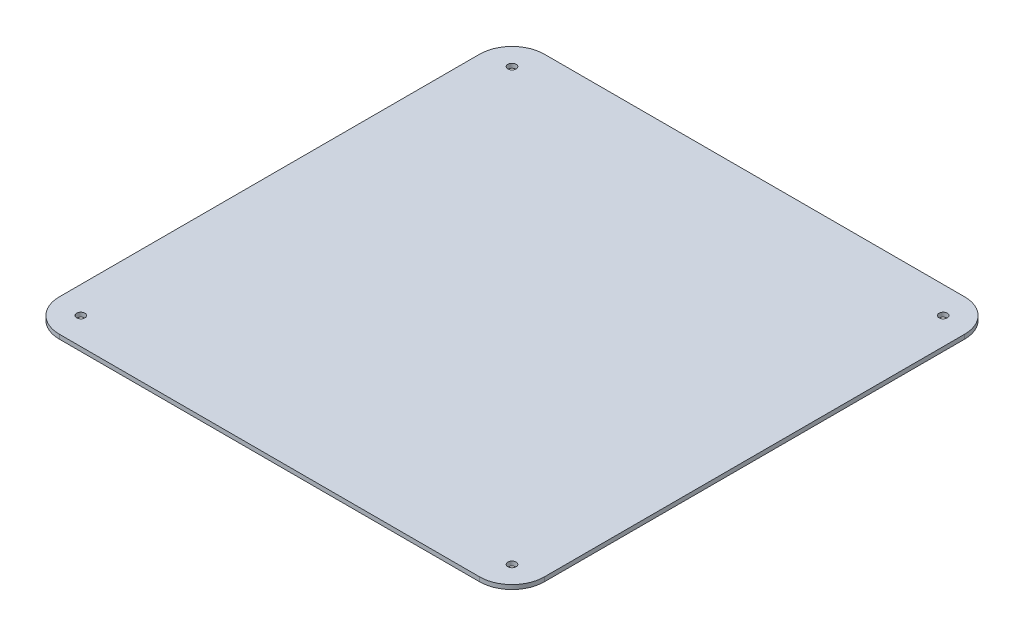
ISO-10303-21;
HEADER;
FILE_DESCRIPTION(('STEP AP214'),'2;1');
FILE_NAME('part.step','',(''),(''),'','','');
FILE_SCHEMA(('AUTOMOTIVE_DESIGN { 1 0 10303 214 1 1 1 1 }'));
ENDSEC;
DATA;
#1=APPLICATION_CONTEXT('core data for automotive mechanical design processes');
#2=APPLICATION_PROTOCOL_DEFINITION('international standard','automotive_design',2000,#1);
#3=PRODUCT_CONTEXT('',#1,'mechanical');
#4=PRODUCT('Part','Part','',(#3));
#5=PRODUCT_RELATED_PRODUCT_CATEGORY('part','',(#4));
#6=PRODUCT_DEFINITION_FORMATION('','',#4);
#7=PRODUCT_DEFINITION_CONTEXT('part definition',#1,'design');
#8=PRODUCT_DEFINITION('design','',#6,#7);
#9=PRODUCT_DEFINITION_SHAPE('','',#8);
#10=(LENGTH_UNIT() NAMED_UNIT(*) SI_UNIT(.MILLI.,.METRE.));
#11=(NAMED_UNIT(*) PLANE_ANGLE_UNIT() SI_UNIT($,.RADIAN.));
#12=(NAMED_UNIT(*) SI_UNIT($,.STERADIAN.) SOLID_ANGLE_UNIT());
#13=UNCERTAINTY_MEASURE_WITH_UNIT(LENGTH_MEASURE(1.E-05),#10,'distance_accuracy_value','');
#14=(GEOMETRIC_REPRESENTATION_CONTEXT(3) GLOBAL_UNCERTAINTY_ASSIGNED_CONTEXT((#13)) GLOBAL_UNIT_ASSIGNED_CONTEXT((#10,
#11,#12)) REPRESENTATION_CONTEXT('',''));
#15=CARTESIAN_POINT('',(0.,0.,0.));
#16=DIRECTION('',(0.,0.,1.));
#17=DIRECTION('',(1.,0.,0.));
#18=AXIS2_PLACEMENT_3D('',#15,#16,#17);
#19=CARTESIAN_POINT('',(225.,-4.,225.));
#20=DIRECTION('',(1.,0.,0.));
#21=DIRECTION('',(0.,0.,-1.));
#22=AXIS2_PLACEMENT_3D('',#19,#20,#21);
#23=PLANE('',#22);
#24=DIRECTION('',(0.,0.,-1.));
#25=VECTOR('',#24,1.);
#26=CARTESIAN_POINT('',(225.,-4.,225.));
#27=LINE('',#26,#25);
#28=CARTESIAN_POINT('',(225.,-4.,195.));
#29=VERTEX_POINT('',#28);
#30=CARTESIAN_POINT('',(225.,-4.,-195.));
#31=VERTEX_POINT('',#30);
#32=EDGE_CURVE('E167',#29,#31,#27,.T.);
#33=ORIENTED_EDGE('',*,*,#32,.T.);
#34=DIRECTION('',(0.,1.,0.));
#35=VECTOR('',#34,1.);
#36=CARTESIAN_POINT('',(225.,-4.,-195.));
#37=LINE('',#36,#35);
#38=CARTESIAN_POINT('',(225.,0.,-195.));
#39=VERTEX_POINT('',#38);
#40=EDGE_CURVE('E114',#31,#39,#37,.T.);
#41=ORIENTED_EDGE('',*,*,#40,.T.);
#42=DIRECTION('',(0.,0.,-1.));
#43=VECTOR('',#42,1.);
#44=CARTESIAN_POINT('',(225.,0.,225.));
#45=LINE('',#44,#43);
#46=CARTESIAN_POINT('',(225.,0.,195.));
#47=VERTEX_POINT('',#46);
#48=EDGE_CURVE('E106',#47,#39,#45,.T.);
#49=ORIENTED_EDGE('',*,*,#48,.F.);
#50=DIRECTION('',(0.,1.,0.));
#51=VECTOR('',#50,1.);
#52=CARTESIAN_POINT('',(225.,-4.,195.));
#53=LINE('',#52,#51);
#54=EDGE_CURVE('E119',#47,#29,#53,.F.);
#55=ORIENTED_EDGE('',*,*,#54,.T.);
#56=EDGE_LOOP('',(#33,#41,#49,#55));
#57=FACE_BOUND('',#56,.T.);
#58=ADVANCED_FACE('F37',(#57),#23,.T.);
#59=CARTESIAN_POINT('',(-225.,-4.,225.));
#60=DIRECTION('',(0.,0.,1.));
#61=DIRECTION('',(1.,0.,0.));
#62=AXIS2_PLACEMENT_3D('',#59,#60,#61);
#63=PLANE('',#62);
#64=DIRECTION('',(1.,0.,0.));
#65=VECTOR('',#64,1.);
#66=CARTESIAN_POINT('',(-225.,0.,225.));
#67=LINE('',#66,#65);
#68=CARTESIAN_POINT('',(-195.,0.,225.));
#69=VERTEX_POINT('',#68);
#70=CARTESIAN_POINT('',(195.,0.,225.));
#71=VERTEX_POINT('',#70);
#72=EDGE_CURVE('E108',#69,#71,#67,.T.);
#73=ORIENTED_EDGE('',*,*,#72,.F.);
#74=DIRECTION('',(0.,1.,0.));
#75=VECTOR('',#74,1.);
#76=CARTESIAN_POINT('',(-195.,-4.,225.));
#77=LINE('',#76,#75);
#78=CARTESIAN_POINT('',(-195.,-4.,225.));
#79=VERTEX_POINT('',#78);
#80=EDGE_CURVE('E11',#69,#79,#77,.F.);
#81=ORIENTED_EDGE('',*,*,#80,.T.);
#82=DIRECTION('',(1.,0.,0.));
#83=VECTOR('',#82,1.);
#84=CARTESIAN_POINT('',(-225.,-4.,225.));
#85=LINE('',#84,#83);
#86=CARTESIAN_POINT('',(195.,-4.,225.));
#87=VERTEX_POINT('',#86);
#88=EDGE_CURVE('E127',#79,#87,#85,.T.);
#89=ORIENTED_EDGE('',*,*,#88,.T.);
#90=DIRECTION('',(0.,1.,0.));
#91=VECTOR('',#90,1.);
#92=CARTESIAN_POINT('',(195.,-4.,225.));
#93=LINE('',#92,#91);
#94=EDGE_CURVE('E45',#87,#71,#93,.T.);
#95=ORIENTED_EDGE('',*,*,#94,.T.);
#96=EDGE_LOOP('',(#73,#81,#89,#95));
#97=FACE_BOUND('',#96,.T.);
#98=ADVANCED_FACE('F156',(#97),#63,.T.);
#99=CARTESIAN_POINT('',(-225.,-4.,225.));
#100=DIRECTION('',(-1.,0.,0.));
#101=DIRECTION('',(0.,0.,1.));
#102=AXIS2_PLACEMENT_3D('',#99,#100,#101);
#103=PLANE('',#102);
#104=DIRECTION('',(0.,0.,1.));
#105=VECTOR('',#104,1.);
#106=CARTESIAN_POINT('',(-225.,0.,225.));
#107=LINE('',#106,#105);
#108=CARTESIAN_POINT('',(-225.,0.,-195.));
#109=VERTEX_POINT('',#108);
#110=CARTESIAN_POINT('',(-225.,0.,195.));
#111=VERTEX_POINT('',#110);
#112=EDGE_CURVE('E165',#109,#111,#107,.T.);
#113=ORIENTED_EDGE('',*,*,#112,.F.);
#114=DIRECTION('',(0.,1.,0.));
#115=VECTOR('',#114,1.);
#116=CARTESIAN_POINT('',(-225.,-4.,-195.));
#117=LINE('',#116,#115);
#118=CARTESIAN_POINT('',(-225.,-4.,-195.));
#119=VERTEX_POINT('',#118);
#120=EDGE_CURVE('E59',#109,#119,#117,.F.);
#121=ORIENTED_EDGE('',*,*,#120,.T.);
#122=DIRECTION('',(0.,0.,1.));
#123=VECTOR('',#122,1.);
#124=CARTESIAN_POINT('',(-225.,-4.,225.));
#125=LINE('',#124,#123);
#126=CARTESIAN_POINT('',(-225.,-4.,195.));
#127=VERTEX_POINT('',#126);
#128=EDGE_CURVE('E131',#119,#127,#125,.T.);
#129=ORIENTED_EDGE('',*,*,#128,.T.);
#130=DIRECTION('',(0.,1.,0.));
#131=VECTOR('',#130,1.);
#132=CARTESIAN_POINT('',(-225.,-4.,195.));
#133=LINE('',#132,#131);
#134=EDGE_CURVE('E152',#127,#111,#133,.T.);
#135=ORIENTED_EDGE('',*,*,#134,.T.);
#136=EDGE_LOOP('',(#113,#121,#129,#135));
#137=FACE_BOUND('',#136,.T.);
#138=ADVANCED_FACE('F164',(#137),#103,.T.);
#139=CARTESIAN_POINT('',(-225.,-4.,-225.));
#140=DIRECTION('',(0.,0.,-1.));
#141=DIRECTION('',(-1.,0.,0.));
#142=AXIS2_PLACEMENT_3D('',#139,#140,#141);
#143=PLANE('',#142);
#144=DIRECTION('',(-1.,0.,0.));
#145=VECTOR('',#144,1.);
#146=CARTESIAN_POINT('',(-225.,0.,-225.));
#147=LINE('',#146,#145);
#148=CARTESIAN_POINT('',(195.,0.,-225.));
#149=VERTEX_POINT('',#148);
#150=CARTESIAN_POINT('',(-195.,0.,-225.));
#151=VERTEX_POINT('',#150);
#152=EDGE_CURVE('E122',#149,#151,#147,.T.);
#153=ORIENTED_EDGE('',*,*,#152,.F.);
#154=DIRECTION('',(0.,1.,0.));
#155=VECTOR('',#154,1.);
#156=CARTESIAN_POINT('',(195.,-4.,-225.));
#157=LINE('',#156,#155);
#158=CARTESIAN_POINT('',(195.,-4.,-225.));
#159=VERTEX_POINT('',#158);
#160=EDGE_CURVE('E144',#149,#159,#157,.F.);
#161=ORIENTED_EDGE('',*,*,#160,.T.);
#162=DIRECTION('',(-1.,0.,0.));
#163=VECTOR('',#162,1.);
#164=CARTESIAN_POINT('',(-225.,-4.,-225.));
#165=LINE('',#164,#163);
#166=CARTESIAN_POINT('',(-195.,-4.,-225.));
#167=VERTEX_POINT('',#166);
#168=EDGE_CURVE('E171',#159,#167,#165,.T.);
#169=ORIENTED_EDGE('',*,*,#168,.T.);
#170=DIRECTION('',(0.,1.,0.));
#171=VECTOR('',#170,1.);
#172=CARTESIAN_POINT('',(-195.,-4.,-225.));
#173=LINE('',#172,#171);
#174=EDGE_CURVE('E141',#167,#151,#173,.T.);
#175=ORIENTED_EDGE('',*,*,#174,.T.);
#176=EDGE_LOOP('',(#153,#161,#169,#175));
#177=FACE_BOUND('',#176,.T.);
#178=ADVANCED_FACE('F233',(#177),#143,.T.);
#179=CARTESIAN_POINT('',(0.,-4.,0.));
#180=DIRECTION('',(0.,-1.,0.));
#181=DIRECTION('',(0.,0.,-1.));
#182=AXIS2_PLACEMENT_3D('',#179,#180,#181);
#183=PLANE('',#182);
#184=CARTESIAN_POINT('',(200.,-4.,-200.));
#185=DIRECTION('',(0.,1.,0.));
#186=DIRECTION('',(0.,0.,1.));
#187=AXIS2_PLACEMENT_3D('',#184,#185,#186);
#188=CIRCLE('',#187,3.8);
#189=CARTESIAN_POINT('',(200.,-4.,-196.2));
#190=VERTEX_POINT('',#189);
#191=EDGE_CURVE('E192',#190,#190,#188,.T.);
#192=ORIENTED_EDGE('',*,*,#191,.T.);
#193=EDGE_LOOP('',(#192));
#194=FACE_BOUND('',#193,.T.);
#195=CARTESIAN_POINT('',(-200.,-4.,200.));
#196=DIRECTION('',(0.,1.,0.));
#197=DIRECTION('',(0.,0.,1.));
#198=AXIS2_PLACEMENT_3D('',#195,#196,#197);
#199=CIRCLE('',#198,3.8);
#200=CARTESIAN_POINT('',(-200.,-4.,203.8));
#201=VERTEX_POINT('',#200);
#202=EDGE_CURVE('E186',#201,#201,#199,.T.);
#203=ORIENTED_EDGE('',*,*,#202,.T.);
#204=EDGE_LOOP('',(#203));
#205=FACE_BOUND('',#204,.T.);
#206=CARTESIAN_POINT('',(-200.,-4.,-200.));
#207=DIRECTION('',(0.,1.,0.));
#208=DIRECTION('',(0.,0.,1.));
#209=AXIS2_PLACEMENT_3D('',#206,#207,#208);
#210=CIRCLE('',#209,3.8);
#211=CARTESIAN_POINT('',(-200.,-4.,-196.2));
#212=VERTEX_POINT('',#211);
#213=EDGE_CURVE('E180',#212,#212,#210,.T.);
#214=ORIENTED_EDGE('',*,*,#213,.T.);
#215=EDGE_LOOP('',(#214));
#216=FACE_BOUND('',#215,.T.);
#217=CARTESIAN_POINT('',(200.,-4.,200.));
#218=DIRECTION('',(0.,1.,0.));
#219=DIRECTION('',(0.,0.,1.));
#220=AXIS2_PLACEMENT_3D('',#217,#218,#219);
#221=CIRCLE('',#220,3.8);
#222=CARTESIAN_POINT('',(200.,-4.,203.8));
#223=VERTEX_POINT('',#222);
#224=EDGE_CURVE('E123',#223,#223,#221,.T.);
#225=ORIENTED_EDGE('',*,*,#224,.T.);
#226=EDGE_LOOP('',(#225));
#227=FACE_BOUND('',#226,.T.);
#228=ORIENTED_EDGE('',*,*,#168,.F.);
#229=CARTESIAN_POINT('',(195.,-4.,-195.));
#230=DIRECTION('',(0.,-1.,0.));
#231=DIRECTION('',(0.,0.,-1.));
#232=AXIS2_PLACEMENT_3D('',#229,#230,#231);
#233=CIRCLE('',#232,30.);
#234=EDGE_CURVE('E150',#159,#31,#233,.T.);
#235=ORIENTED_EDGE('',*,*,#234,.T.);
#236=ORIENTED_EDGE('',*,*,#32,.F.);
#237=CARTESIAN_POINT('',(195.,-4.,195.));
#238=DIRECTION('',(0.,-1.,0.));
#239=DIRECTION('',(0.,0.,-1.));
#240=AXIS2_PLACEMENT_3D('',#237,#238,#239);
#241=CIRCLE('',#240,30.);
#242=EDGE_CURVE('E126',#29,#87,#241,.T.);
#243=ORIENTED_EDGE('',*,*,#242,.T.);
#244=ORIENTED_EDGE('',*,*,#88,.F.);
#245=CARTESIAN_POINT('',(-195.,-4.,195.));
#246=DIRECTION('',(0.,-1.,0.));
#247=DIRECTION('',(0.,0.,-1.));
#248=AXIS2_PLACEMENT_3D('',#245,#246,#247);
#249=CIRCLE('',#248,30.);
#250=EDGE_CURVE('E52',#79,#127,#249,.T.);
#251=ORIENTED_EDGE('',*,*,#250,.T.);
#252=ORIENTED_EDGE('',*,*,#128,.F.);
#253=CARTESIAN_POINT('',(-195.,-4.,-195.));
#254=DIRECTION('',(0.,-1.,0.));
#255=DIRECTION('',(0.,0.,-1.));
#256=AXIS2_PLACEMENT_3D('',#253,#254,#255);
#257=CIRCLE('',#256,30.);
#258=EDGE_CURVE('E148',#119,#167,#257,.T.);
#259=ORIENTED_EDGE('',*,*,#258,.T.);
#260=EDGE_LOOP('',(#228,#235,#236,#243,#244,#251,#252,#259));
#261=FACE_BOUND('',#260,.T.);
#262=ADVANCED_FACE('F159',(#194,#205,#216,#227,#261),#183,.T.);
#263=CARTESIAN_POINT('',(0.,0.,0.));
#264=DIRECTION('',(0.,-1.,0.));
#265=DIRECTION('',(0.,0.,-1.));
#266=AXIS2_PLACEMENT_3D('',#263,#264,#265);
#267=PLANE('',#266);
#268=CARTESIAN_POINT('',(200.,0.,-200.));
#269=DIRECTION('',(0.,1.,0.));
#270=DIRECTION('',(0.,0.,1.));
#271=AXIS2_PLACEMENT_3D('',#268,#269,#270);
#272=CIRCLE('',#271,3.8);
#273=CARTESIAN_POINT('',(200.,0.,-196.2));
#274=VERTEX_POINT('',#273);
#275=EDGE_CURVE('E195',#274,#274,#272,.T.);
#276=ORIENTED_EDGE('',*,*,#275,.F.);
#277=EDGE_LOOP('',(#276));
#278=FACE_BOUND('',#277,.T.);
#279=CARTESIAN_POINT('',(-200.,0.,200.));
#280=DIRECTION('',(0.,1.,0.));
#281=DIRECTION('',(0.,0.,1.));
#282=AXIS2_PLACEMENT_3D('',#279,#280,#281);
#283=CIRCLE('',#282,3.8);
#284=CARTESIAN_POINT('',(-200.,0.,203.8));
#285=VERTEX_POINT('',#284);
#286=EDGE_CURVE('E189',#285,#285,#283,.T.);
#287=ORIENTED_EDGE('',*,*,#286,.F.);
#288=EDGE_LOOP('',(#287));
#289=FACE_BOUND('',#288,.T.);
#290=CARTESIAN_POINT('',(-200.,0.,-200.));
#291=DIRECTION('',(0.,1.,0.));
#292=DIRECTION('',(0.,0.,1.));
#293=AXIS2_PLACEMENT_3D('',#290,#291,#292);
#294=CIRCLE('',#293,3.8);
#295=CARTESIAN_POINT('',(-200.,0.,-196.2));
#296=VERTEX_POINT('',#295);
#297=EDGE_CURVE('E183',#296,#296,#294,.T.);
#298=ORIENTED_EDGE('',*,*,#297,.F.);
#299=EDGE_LOOP('',(#298));
#300=FACE_BOUND('',#299,.T.);
#301=CARTESIAN_POINT('',(200.,0.,200.));
#302=DIRECTION('',(0.,1.,0.));
#303=DIRECTION('',(0.,0.,1.));
#304=AXIS2_PLACEMENT_3D('',#301,#302,#303);
#305=CIRCLE('',#304,3.8);
#306=CARTESIAN_POINT('',(200.,0.,203.8));
#307=VERTEX_POINT('',#306);
#308=EDGE_CURVE('E177',#307,#307,#305,.T.);
#309=ORIENTED_EDGE('',*,*,#308,.F.);
#310=EDGE_LOOP('',(#309));
#311=FACE_BOUND('',#310,.T.);
#312=ORIENTED_EDGE('',*,*,#48,.T.);
#313=CARTESIAN_POINT('',(195.,0.,-195.));
#314=DIRECTION('',(0.,-1.,0.));
#315=DIRECTION('',(0.,0.,-1.));
#316=AXIS2_PLACEMENT_3D('',#313,#314,#315);
#317=CIRCLE('',#316,30.);
#318=EDGE_CURVE('E139',#39,#149,#317,.F.);
#319=ORIENTED_EDGE('',*,*,#318,.T.);
#320=ORIENTED_EDGE('',*,*,#152,.T.);
#321=CARTESIAN_POINT('',(-195.,0.,-195.));
#322=DIRECTION('',(0.,-1.,0.));
#323=DIRECTION('',(0.,0.,-1.));
#324=AXIS2_PLACEMENT_3D('',#321,#322,#323);
#325=CIRCLE('',#324,30.);
#326=EDGE_CURVE('E137',#151,#109,#325,.F.);
#327=ORIENTED_EDGE('',*,*,#326,.T.);
#328=ORIENTED_EDGE('',*,*,#112,.T.);
#329=CARTESIAN_POINT('',(-195.,0.,195.));
#330=DIRECTION('',(0.,-1.,0.));
#331=DIRECTION('',(0.,0.,-1.));
#332=AXIS2_PLACEMENT_3D('',#329,#330,#331);
#333=CIRCLE('',#332,30.);
#334=EDGE_CURVE('E113',#111,#69,#333,.F.);
#335=ORIENTED_EDGE('',*,*,#334,.T.);
#336=ORIENTED_EDGE('',*,*,#72,.T.);
#337=CARTESIAN_POINT('',(195.,0.,195.));
#338=DIRECTION('',(0.,-1.,0.));
#339=DIRECTION('',(0.,0.,-1.));
#340=AXIS2_PLACEMENT_3D('',#337,#338,#339);
#341=CIRCLE('',#340,30.);
#342=EDGE_CURVE('E103',#71,#47,#341,.F.);
#343=ORIENTED_EDGE('',*,*,#342,.T.);
#344=EDGE_LOOP('',(#312,#319,#320,#327,#328,#335,#336,#343));
#345=FACE_BOUND('',#344,.T.);
#346=ADVANCED_FACE('F105',(#278,#289,#300,#311,#345),#267,.F.);
#347=CARTESIAN_POINT('',(195.,-4.,-195.));
#348=DIRECTION('',(0.,1.,0.));
#349=DIRECTION('',(0.,0.,1.));
#350=AXIS2_PLACEMENT_3D('',#347,#348,#349);
#351=CYLINDRICAL_SURFACE('',#350,30.);
#352=ORIENTED_EDGE('',*,*,#234,.F.);
#353=ORIENTED_EDGE('',*,*,#160,.F.);
#354=ORIENTED_EDGE('',*,*,#318,.F.);
#355=ORIENTED_EDGE('',*,*,#40,.F.);
#356=EDGE_LOOP('',(#352,#353,#354,#355));
#357=FACE_BOUND('',#356,.T.);
#358=ADVANCED_FACE('F203',(#357),#351,.T.);
#359=CARTESIAN_POINT('',(-195.,-4.,-195.));
#360=DIRECTION('',(0.,1.,0.));
#361=DIRECTION('',(0.,0.,1.));
#362=AXIS2_PLACEMENT_3D('',#359,#360,#361);
#363=CYLINDRICAL_SURFACE('',#362,30.);
#364=ORIENTED_EDGE('',*,*,#258,.F.);
#365=ORIENTED_EDGE('',*,*,#120,.F.);
#366=ORIENTED_EDGE('',*,*,#326,.F.);
#367=ORIENTED_EDGE('',*,*,#174,.F.);
#368=EDGE_LOOP('',(#364,#365,#366,#367));
#369=FACE_BOUND('',#368,.T.);
#370=ADVANCED_FACE('F237',(#369),#363,.T.);
#371=CARTESIAN_POINT('',(-195.,-4.,195.));
#372=DIRECTION('',(0.,1.,0.));
#373=DIRECTION('',(0.,0.,1.));
#374=AXIS2_PLACEMENT_3D('',#371,#372,#373);
#375=CYLINDRICAL_SURFACE('',#374,30.);
#376=ORIENTED_EDGE('',*,*,#250,.F.);
#377=ORIENTED_EDGE('',*,*,#80,.F.);
#378=ORIENTED_EDGE('',*,*,#334,.F.);
#379=ORIENTED_EDGE('',*,*,#134,.F.);
#380=EDGE_LOOP('',(#376,#377,#378,#379));
#381=FACE_BOUND('',#380,.T.);
#382=ADVANCED_FACE('F162',(#381),#375,.T.);
#383=CARTESIAN_POINT('',(195.,-4.,195.));
#384=DIRECTION('',(0.,1.,0.));
#385=DIRECTION('',(0.,0.,1.));
#386=AXIS2_PLACEMENT_3D('',#383,#384,#385);
#387=CYLINDRICAL_SURFACE('',#386,30.);
#388=ORIENTED_EDGE('',*,*,#242,.F.);
#389=ORIENTED_EDGE('',*,*,#54,.F.);
#390=ORIENTED_EDGE('',*,*,#342,.F.);
#391=ORIENTED_EDGE('',*,*,#94,.F.);
#392=EDGE_LOOP('',(#388,#389,#390,#391));
#393=FACE_BOUND('',#392,.T.);
#394=ADVANCED_FACE('F39',(#393),#387,.T.);
#395=CARTESIAN_POINT('',(200.,0.,200.));
#396=DIRECTION('',(0.,1.,0.));
#397=DIRECTION('',(0.,0.,1.));
#398=AXIS2_PLACEMENT_3D('',#395,#396,#397);
#399=CYLINDRICAL_SURFACE('',#398,3.8);
#400=ORIENTED_EDGE('',*,*,#224,.F.);
#401=EDGE_LOOP('',(#400));
#402=FACE_BOUND('',#401,.T.);
#403=ORIENTED_EDGE('',*,*,#308,.T.);
#404=EDGE_LOOP('',(#403));
#405=FACE_BOUND('',#404,.T.);
#406=ADVANCED_FACE('F211',(#402,#405),#399,.F.);
#407=CARTESIAN_POINT('',(-200.,0.,-200.));
#408=DIRECTION('',(0.,1.,0.));
#409=DIRECTION('',(0.,0.,1.));
#410=AXIS2_PLACEMENT_3D('',#407,#408,#409);
#411=CYLINDRICAL_SURFACE('',#410,3.8);
#412=ORIENTED_EDGE('',*,*,#213,.F.);
#413=EDGE_LOOP('',(#412));
#414=FACE_BOUND('',#413,.T.);
#415=ORIENTED_EDGE('',*,*,#297,.T.);
#416=EDGE_LOOP('',(#415));
#417=FACE_BOUND('',#416,.T.);
#418=ADVANCED_FACE('F213',(#414,#417),#411,.F.);
#419=CARTESIAN_POINT('',(-200.,0.,200.));
#420=DIRECTION('',(0.,1.,0.));
#421=DIRECTION('',(0.,0.,1.));
#422=AXIS2_PLACEMENT_3D('',#419,#420,#421);
#423=CYLINDRICAL_SURFACE('',#422,3.8);
#424=ORIENTED_EDGE('',*,*,#202,.F.);
#425=EDGE_LOOP('',(#424));
#426=FACE_BOUND('',#425,.T.);
#427=ORIENTED_EDGE('',*,*,#286,.T.);
#428=EDGE_LOOP('',(#427));
#429=FACE_BOUND('',#428,.T.);
#430=ADVANCED_FACE('F220',(#426,#429),#423,.F.);
#431=CARTESIAN_POINT('',(200.,0.,-200.));
#432=DIRECTION('',(0.,1.,0.));
#433=DIRECTION('',(0.,0.,1.));
#434=AXIS2_PLACEMENT_3D('',#431,#432,#433);
#435=CYLINDRICAL_SURFACE('',#434,3.8);
#436=ORIENTED_EDGE('',*,*,#191,.F.);
#437=EDGE_LOOP('',(#436));
#438=FACE_BOUND('',#437,.T.);
#439=ORIENTED_EDGE('',*,*,#275,.T.);
#440=EDGE_LOOP('',(#439));
#441=FACE_BOUND('',#440,.T.);
#442=ADVANCED_FACE('F199',(#438,#441),#435,.F.);
#443=CLOSED_SHELL('',(#58,#98,#138,#178,#262,#346,#358,#370,#382,#394,#406,#418,#430,#442));
#444=MANIFOLD_SOLID_BREP('B2',#443);
#445=ADVANCED_BREP_SHAPE_REPRESENTATION('',(#18,#444),#14);
#446=SHAPE_DEFINITION_REPRESENTATION(#9,#445);
ENDSEC;
END-ISO-10303-21;
